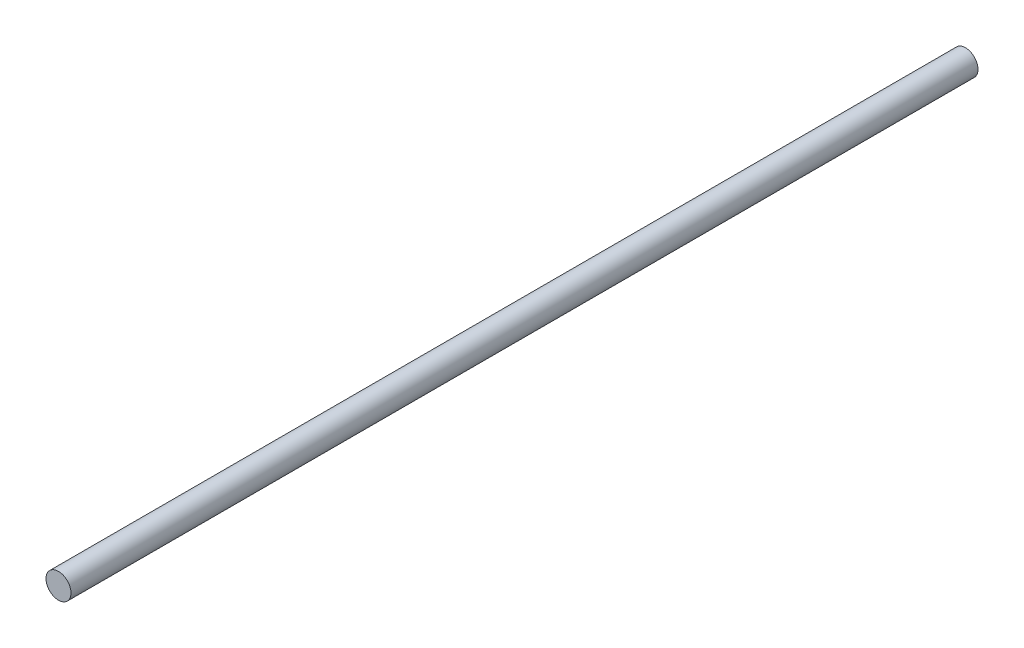
ISO-10303-21;
HEADER;
FILE_DESCRIPTION(('STEP AP214'),'2;1');
FILE_NAME('part.step','',(''),(''),'','','');
FILE_SCHEMA(('AUTOMOTIVE_DESIGN { 1 0 10303 214 1 1 1 1 }'));
ENDSEC;
DATA;
#1=APPLICATION_CONTEXT('core data for automotive mechanical design processes');
#2=APPLICATION_PROTOCOL_DEFINITION('international standard','automotive_design',2000,#1);
#3=PRODUCT_CONTEXT('',#1,'mechanical');
#4=PRODUCT('Part','Part','',(#3));
#5=PRODUCT_RELATED_PRODUCT_CATEGORY('part','',(#4));
#6=PRODUCT_DEFINITION_FORMATION('','',#4);
#7=PRODUCT_DEFINITION_CONTEXT('part definition',#1,'design');
#8=PRODUCT_DEFINITION('design','',#6,#7);
#9=PRODUCT_DEFINITION_SHAPE('','',#8);
#10=(LENGTH_UNIT() NAMED_UNIT(*) SI_UNIT(.MILLI.,.METRE.));
#11=(NAMED_UNIT(*) PLANE_ANGLE_UNIT() SI_UNIT($,.RADIAN.));
#12=(NAMED_UNIT(*) SI_UNIT($,.STERADIAN.) SOLID_ANGLE_UNIT());
#13=UNCERTAINTY_MEASURE_WITH_UNIT(LENGTH_MEASURE(1.E-05),#10,'distance_accuracy_value','');
#14=(GEOMETRIC_REPRESENTATION_CONTEXT(3) GLOBAL_UNCERTAINTY_ASSIGNED_CONTEXT((#13)) GLOBAL_UNIT_ASSIGNED_CONTEXT((#10,
#11,#12)) REPRESENTATION_CONTEXT('',''));
#15=CARTESIAN_POINT('',(0.,0.,0.));
#16=DIRECTION('',(0.,0.,1.));
#17=DIRECTION('',(1.,0.,0.));
#18=AXIS2_PLACEMENT_3D('',#15,#16,#17);
#19=CARTESIAN_POINT('',(0.,0.,460.502));
#20=DIRECTION('',(0.,0.,-1.));
#21=DIRECTION('',(-1.,0.,0.));
#22=AXIS2_PLACEMENT_3D('',#19,#20,#21);
#23=CYLINDRICAL_SURFACE('',#22,6.35);
#24=CARTESIAN_POINT('',(0.,0.,460.502));
#25=DIRECTION('',(0.,0.,1.));
#26=DIRECTION('',(1.,0.,0.));
#27=AXIS2_PLACEMENT_3D('',#24,#25,#26);
#28=CIRCLE('',#27,6.35);
#29=CARTESIAN_POINT('',(6.35,0.,460.502));
#30=VERTEX_POINT('',#29);
#31=EDGE_CURVE('E10',#30,#30,#28,.T.);
#32=ORIENTED_EDGE('',*,*,#31,.F.);
#33=EDGE_LOOP('',(#32));
#34=FACE_BOUND('',#33,.T.);
#35=CARTESIAN_POINT('',(0.,0.,0.));
#36=DIRECTION('',(0.,0.,1.));
#37=DIRECTION('',(1.,0.,0.));
#38=AXIS2_PLACEMENT_3D('',#35,#36,#37);
#39=CIRCLE('',#38,6.35);
#40=CARTESIAN_POINT('',(6.35,0.,0.));
#41=VERTEX_POINT('',#40);
#42=EDGE_CURVE('E35',#41,#41,#39,.T.);
#43=ORIENTED_EDGE('',*,*,#42,.T.);
#44=EDGE_LOOP('',(#43));
#45=FACE_BOUND('',#44,.T.);
#46=ADVANCED_FACE('F32',(#34,#45),#23,.T.);
#47=CARTESIAN_POINT('',(0.,0.,460.502));
#48=DIRECTION('',(0.,0.,1.));
#49=DIRECTION('',(1.,0.,0.));
#50=AXIS2_PLACEMENT_3D('',#47,#48,#49);
#51=PLANE('',#50);
#52=ORIENTED_EDGE('',*,*,#31,.T.);
#53=EDGE_LOOP('',(#52));
#54=FACE_BOUND('',#53,.T.);
#55=ADVANCED_FACE('F47',(#54),#51,.T.);
#56=CARTESIAN_POINT('',(0.,0.,0.));
#57=DIRECTION('',(0.,0.,1.));
#58=DIRECTION('',(1.,0.,0.));
#59=AXIS2_PLACEMENT_3D('',#56,#57,#58);
#60=PLANE('',#59);
#61=ORIENTED_EDGE('',*,*,#42,.F.);
#62=EDGE_LOOP('',(#61));
#63=FACE_BOUND('',#62,.T.);
#64=ADVANCED_FACE('F45',(#63),#60,.F.);
#65=CLOSED_SHELL('',(#46,#55,#64));
#66=MANIFOLD_SOLID_BREP('B2',#65);
#67=ADVANCED_BREP_SHAPE_REPRESENTATION('',(#18,#66),#14);
#68=SHAPE_DEFINITION_REPRESENTATION(#9,#67);
ENDSEC;
END-ISO-10303-21;
